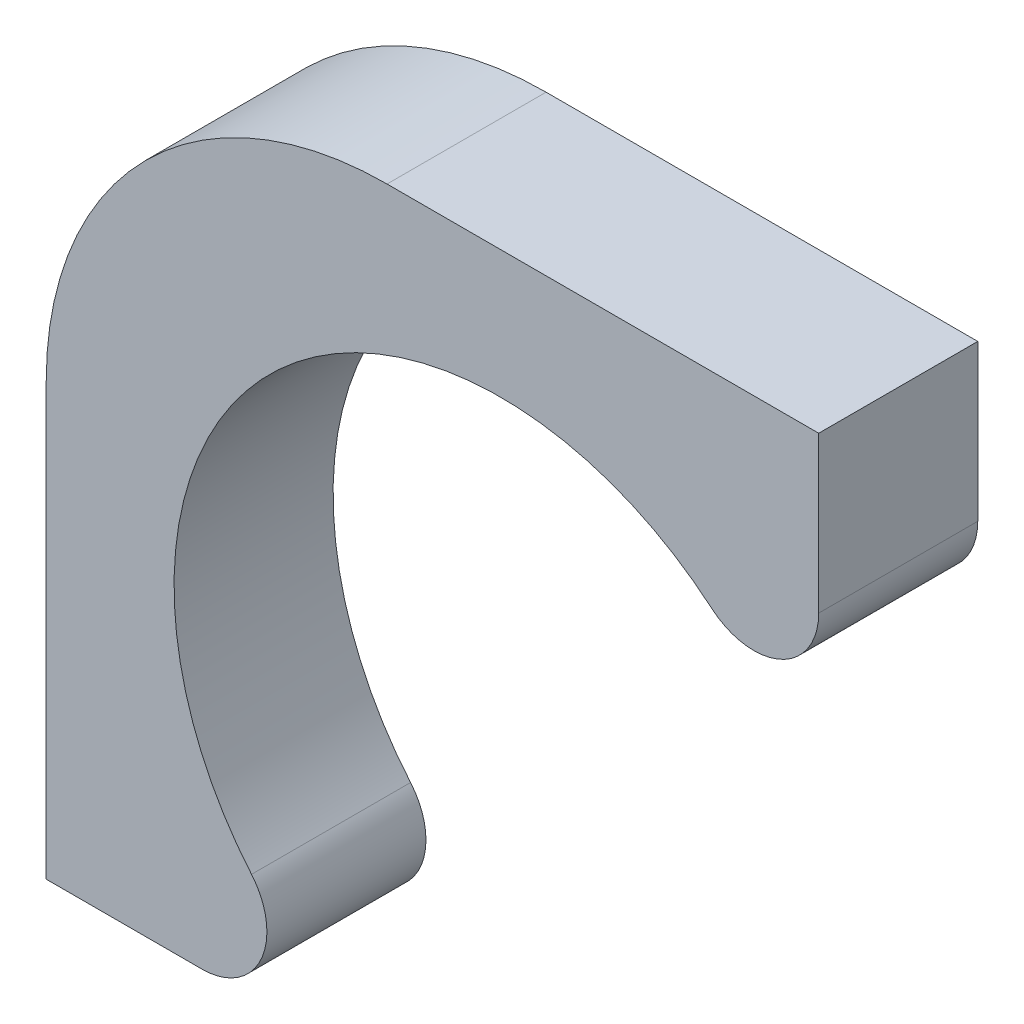
ISO-10303-21;
HEADER;
FILE_DESCRIPTION(('STEP AP214'),'2;1');
FILE_NAME('part.step','',(''),(''),'','','');
FILE_SCHEMA(('AUTOMOTIVE_DESIGN { 1 0 10303 214 1 1 1 1 }'));
ENDSEC;
DATA;
#1=APPLICATION_CONTEXT('core data for automotive mechanical design processes');
#2=APPLICATION_PROTOCOL_DEFINITION('international standard','automotive_design',2000,#1);
#3=PRODUCT_CONTEXT('',#1,'mechanical');
#4=PRODUCT('Part','Part','',(#3));
#5=PRODUCT_RELATED_PRODUCT_CATEGORY('part','',(#4));
#6=PRODUCT_DEFINITION_FORMATION('','',#4);
#7=PRODUCT_DEFINITION_CONTEXT('part definition',#1,'design');
#8=PRODUCT_DEFINITION('design','',#6,#7);
#9=PRODUCT_DEFINITION_SHAPE('','',#8);
#10=(LENGTH_UNIT() NAMED_UNIT(*) SI_UNIT(.MILLI.,.METRE.));
#11=(NAMED_UNIT(*) PLANE_ANGLE_UNIT() SI_UNIT($,.RADIAN.));
#12=(NAMED_UNIT(*) SI_UNIT($,.STERADIAN.) SOLID_ANGLE_UNIT());
#13=UNCERTAINTY_MEASURE_WITH_UNIT(LENGTH_MEASURE(1.E-05),#10,'distance_accuracy_value','');
#14=(GEOMETRIC_REPRESENTATION_CONTEXT(3) GLOBAL_UNCERTAINTY_ASSIGNED_CONTEXT((#13)) GLOBAL_UNIT_ASSIGNED_CONTEXT((#10,
#11,#12)) REPRESENTATION_CONTEXT('',''));
#15=CARTESIAN_POINT('',(0.,0.,0.));
#16=DIRECTION('',(0.,0.,1.));
#17=DIRECTION('',(1.,0.,0.));
#18=AXIS2_PLACEMENT_3D('',#15,#16,#17);
#19=CARTESIAN_POINT('',(-2.62868893926057,-2.22868893926067,1.4));
#20=DIRECTION('',(0.,0.,-1.));
#21=DIRECTION('',(-1.,0.,0.));
#22=AXIS2_PLACEMENT_3D('',#19,#20,#21);
#23=CYLINDRICAL_SURFACE('',#22,0.571311060739252);
#24=CARTESIAN_POINT('',(-2.62868893926057,-2.22868893926067,0.));
#25=DIRECTION('',(0.,0.,1.));
#26=DIRECTION('',(1.,0.,0.));
#27=AXIS2_PLACEMENT_3D('',#24,#25,#26);
#28=CIRCLE('',#27,0.571311060739252);
#29=CARTESIAN_POINT('',(-2.62868893926057,-2.79999999999992,0.));
#30=VERTEX_POINT('',#29);
#31=CARTESIAN_POINT('',(-2.19291891160661,-1.85922877750913,0.));
#32=VERTEX_POINT('',#31);
#33=EDGE_CURVE('E131',#30,#32,#28,.T.);
#34=ORIENTED_EDGE('',*,*,#33,.T.);
#35=DIRECTION('',(0.,0.,-1.));
#36=VECTOR('',#35,1.);
#37=CARTESIAN_POINT('',(-2.19291891160661,-1.85922877750913,1.4));
#38=LINE('',#37,#36);
#39=CARTESIAN_POINT('',(-2.19291891160661,-1.85922877750913,1.4));
#40=VERTEX_POINT('',#39);
#41=EDGE_CURVE('E11',#40,#32,#38,.T.);
#42=ORIENTED_EDGE('',*,*,#41,.F.);
#43=CARTESIAN_POINT('',(-2.62868893926057,-2.22868893926067,1.4));
#44=DIRECTION('',(0.,0.,1.));
#45=DIRECTION('',(1.,0.,0.));
#46=AXIS2_PLACEMENT_3D('',#43,#44,#45);
#47=CIRCLE('',#46,0.571311060739252);
#48=CARTESIAN_POINT('',(-2.62868893926057,-2.79999999999992,1.4));
#49=VERTEX_POINT('',#48);
#50=EDGE_CURVE('E145',#49,#40,#47,.T.);
#51=ORIENTED_EDGE('',*,*,#50,.F.);
#52=DIRECTION('',(0.,0.,-1.));
#53=VECTOR('',#52,1.);
#54=CARTESIAN_POINT('',(-2.62868893926057,-2.79999999999992,1.4));
#55=LINE('',#54,#53);
#56=EDGE_CURVE('E127',#49,#30,#55,.T.);
#57=ORIENTED_EDGE('',*,*,#56,.T.);
#58=EDGE_LOOP('',(#34,#42,#51,#57));
#59=FACE_BOUND('',#58,.T.);
#60=ADVANCED_FACE('F35',(#59),#23,.T.);
#61=CARTESIAN_POINT('',(0.,0.,1.4));
#62=DIRECTION('',(0.,0.,-1.));
#63=DIRECTION('',(-1.,0.,0.));
#64=AXIS2_PLACEMENT_3D('',#61,#62,#63);
#65=CYLINDRICAL_SURFACE('',#64,2.875);
#66=CARTESIAN_POINT('',(0.,0.,0.));
#67=DIRECTION('',(0.,0.,-1.));
#68=DIRECTION('',(-1.,0.,0.));
#69=AXIS2_PLACEMENT_3D('',#66,#67,#68);
#70=CIRCLE('',#69,2.875);
#71=CARTESIAN_POINT('',(1.85922877750913,2.19291891160661,0.));
#72=VERTEX_POINT('',#71);
#73=EDGE_CURVE('E134',#32,#72,#70,.T.);
#74=ORIENTED_EDGE('',*,*,#73,.T.);
#75=DIRECTION('',(0.,0.,-1.));
#76=VECTOR('',#75,1.);
#77=CARTESIAN_POINT('',(1.85922877750913,2.19291891160661,1.4));
#78=LINE('',#77,#76);
#79=CARTESIAN_POINT('',(1.85922877750913,2.19291891160661,1.4));
#80=VERTEX_POINT('',#79);
#81=EDGE_CURVE('E43',#80,#72,#78,.T.);
#82=ORIENTED_EDGE('',*,*,#81,.F.);
#83=CARTESIAN_POINT('',(0.,0.,1.4));
#84=DIRECTION('',(0.,0.,-1.));
#85=DIRECTION('',(-1.,0.,0.));
#86=AXIS2_PLACEMENT_3D('',#83,#84,#85);
#87=CIRCLE('',#86,2.875);
#88=EDGE_CURVE('E94',#40,#80,#87,.T.);
#89=ORIENTED_EDGE('',*,*,#88,.F.);
#90=ORIENTED_EDGE('',*,*,#41,.T.);
#91=EDGE_LOOP('',(#74,#82,#89,#90));
#92=FACE_BOUND('',#91,.T.);
#93=ADVANCED_FACE('F180',(#92),#65,.F.);
#94=CARTESIAN_POINT('',(2.22868893926067,2.62868893926057,1.4));
#95=DIRECTION('',(0.,0.,-1.));
#96=DIRECTION('',(-1.,0.,0.));
#97=AXIS2_PLACEMENT_3D('',#94,#95,#96);
#98=CYLINDRICAL_SURFACE('',#97,0.571311060739252);
#99=CARTESIAN_POINT('',(2.22868893926067,2.62868893926057,0.));
#100=DIRECTION('',(0.,0.,1.));
#101=DIRECTION('',(-1.,0.,0.));
#102=AXIS2_PLACEMENT_3D('',#99,#100,#101);
#103=CIRCLE('',#102,0.571311060739252);
#104=CARTESIAN_POINT('',(2.79999999999992,2.62868893926057,0.));
#105=VERTEX_POINT('',#104);
#106=EDGE_CURVE('E136',#72,#105,#103,.T.);
#107=ORIENTED_EDGE('',*,*,#106,.T.);
#108=DIRECTION('',(0.,0.,-1.));
#109=VECTOR('',#108,1.);
#110=CARTESIAN_POINT('',(2.79999999999992,2.62868893926057,1.4));
#111=LINE('',#110,#109);
#112=CARTESIAN_POINT('',(2.79999999999992,2.62868893926057,1.4));
#113=VERTEX_POINT('',#112);
#114=EDGE_CURVE('E152',#113,#105,#111,.T.);
#115=ORIENTED_EDGE('',*,*,#114,.F.);
#116=CARTESIAN_POINT('',(2.22868893926067,2.62868893926057,1.4));
#117=DIRECTION('',(0.,0.,1.));
#118=DIRECTION('',(-1.,0.,0.));
#119=AXIS2_PLACEMENT_3D('',#116,#117,#118);
#120=CIRCLE('',#119,0.571311060739252);
#121=EDGE_CURVE('E160',#80,#113,#120,.T.);
#122=ORIENTED_EDGE('',*,*,#121,.F.);
#123=ORIENTED_EDGE('',*,*,#81,.T.);
#124=EDGE_LOOP('',(#107,#115,#122,#123));
#125=FACE_BOUND('',#124,.T.);
#126=ADVANCED_FACE('F158',(#125),#98,.T.);
#127=CARTESIAN_POINT('',(2.79999999999992,4.,1.4));
#128=DIRECTION('',(-1.,0.,0.));
#129=DIRECTION('',(0.,0.,1.));
#130=AXIS2_PLACEMENT_3D('',#127,#128,#129);
#131=PLANE('',#130);
#132=DIRECTION('',(0.,1.,0.));
#133=VECTOR('',#132,1.);
#134=CARTESIAN_POINT('',(2.79999999999992,4.,0.));
#135=LINE('',#134,#133);
#136=CARTESIAN_POINT('',(2.79999999999992,4.,0.));
#137=VERTEX_POINT('',#136);
#138=EDGE_CURVE('E138',#105,#137,#135,.T.);
#139=ORIENTED_EDGE('',*,*,#138,.T.);
#140=DIRECTION('',(0.,0.,-1.));
#141=VECTOR('',#140,1.);
#142=CARTESIAN_POINT('',(2.79999999999992,4.,1.4));
#143=LINE('',#142,#141);
#144=CARTESIAN_POINT('',(2.79999999999992,4.,1.4));
#145=VERTEX_POINT('',#144);
#146=EDGE_CURVE('E149',#145,#137,#143,.T.);
#147=ORIENTED_EDGE('',*,*,#146,.F.);
#148=DIRECTION('',(0.,1.,0.));
#149=VECTOR('',#148,1.);
#150=CARTESIAN_POINT('',(2.79999999999992,4.,1.4));
#151=LINE('',#150,#149);
#152=EDGE_CURVE('E172',#113,#145,#151,.T.);
#153=ORIENTED_EDGE('',*,*,#152,.F.);
#154=ORIENTED_EDGE('',*,*,#114,.T.);
#155=EDGE_LOOP('',(#139,#147,#153,#154));
#156=FACE_BOUND('',#155,.T.);
#157=ADVANCED_FACE('F168',(#156),#131,.F.);
#158=CARTESIAN_POINT('',(2.79999999999992,4.,1.4));
#159=DIRECTION('',(0.,-1.,0.));
#160=DIRECTION('',(1.,0.,0.));
#161=AXIS2_PLACEMENT_3D('',#158,#159,#160);
#162=PLANE('',#161);
#163=DIRECTION('',(-1.,0.,0.));
#164=VECTOR('',#163,1.);
#165=CARTESIAN_POINT('',(2.79999999999992,4.,0.));
#166=LINE('',#165,#164);
#167=CARTESIAN_POINT('',(-1.00000000000009,4.,0.));
#168=VERTEX_POINT('',#167);
#169=EDGE_CURVE('E140',#137,#168,#166,.T.);
#170=ORIENTED_EDGE('',*,*,#169,.T.);
#171=DIRECTION('',(0.,0.,-1.));
#172=VECTOR('',#171,1.);
#173=CARTESIAN_POINT('',(-1.00000000000009,4.,1.4));
#174=LINE('',#173,#172);
#175=CARTESIAN_POINT('',(-1.00000000000009,4.,1.4));
#176=VERTEX_POINT('',#175);
#177=EDGE_CURVE('E122',#176,#168,#174,.T.);
#178=ORIENTED_EDGE('',*,*,#177,.F.);
#179=DIRECTION('',(-1.,0.,0.));
#180=VECTOR('',#179,1.);
#181=CARTESIAN_POINT('',(2.79999999999992,4.,1.4));
#182=LINE('',#181,#180);
#183=EDGE_CURVE('E113',#145,#176,#182,.T.);
#184=ORIENTED_EDGE('',*,*,#183,.F.);
#185=ORIENTED_EDGE('',*,*,#146,.T.);
#186=EDGE_LOOP('',(#170,#178,#184,#185));
#187=FACE_BOUND('',#186,.T.);
#188=ADVANCED_FACE('F171',(#187),#162,.F.);
#189=CARTESIAN_POINT('',(-1.00000000000009,1.00000000000009,1.4));
#190=DIRECTION('',(0.,0.,-1.));
#191=DIRECTION('',(-1.,0.,0.));
#192=AXIS2_PLACEMENT_3D('',#189,#190,#191);
#193=CYLINDRICAL_SURFACE('',#192,2.99999999999991);
#194=CARTESIAN_POINT('',(-1.00000000000009,1.00000000000009,0.));
#195=DIRECTION('',(0.,0.,1.));
#196=DIRECTION('',(1.,0.,0.));
#197=AXIS2_PLACEMENT_3D('',#194,#195,#196);
#198=CIRCLE('',#197,2.99999999999991);
#199=CARTESIAN_POINT('',(-4.,1.00000000000009,0.));
#200=VERTEX_POINT('',#199);
#201=EDGE_CURVE('E121',#168,#200,#198,.T.);
#202=ORIENTED_EDGE('',*,*,#201,.T.);
#203=DIRECTION('',(0.,0.,-1.));
#204=VECTOR('',#203,1.);
#205=CARTESIAN_POINT('',(-4.,1.00000000000009,1.4));
#206=LINE('',#205,#204);
#207=CARTESIAN_POINT('',(-4.,1.00000000000009,1.4));
#208=VERTEX_POINT('',#207);
#209=EDGE_CURVE('E118',#208,#200,#206,.T.);
#210=ORIENTED_EDGE('',*,*,#209,.F.);
#211=CARTESIAN_POINT('',(-1.00000000000009,1.00000000000009,1.4));
#212=DIRECTION('',(0.,0.,1.));
#213=DIRECTION('',(1.,0.,0.));
#214=AXIS2_PLACEMENT_3D('',#211,#212,#213);
#215=CIRCLE('',#214,2.99999999999991);
#216=EDGE_CURVE('E107',#176,#208,#215,.T.);
#217=ORIENTED_EDGE('',*,*,#216,.F.);
#218=ORIENTED_EDGE('',*,*,#177,.T.);
#219=EDGE_LOOP('',(#202,#210,#217,#218));
#220=FACE_BOUND('',#219,.T.);
#221=ADVANCED_FACE('F119',(#220),#193,.T.);
#222=CARTESIAN_POINT('',(-4.,1.00000000000009,1.4));
#223=DIRECTION('',(1.,0.,0.));
#224=DIRECTION('',(0.,1.,0.));
#225=AXIS2_PLACEMENT_3D('',#222,#223,#224);
#226=PLANE('',#225);
#227=DIRECTION('',(0.,-1.,0.));
#228=VECTOR('',#227,1.);
#229=CARTESIAN_POINT('',(-4.,1.00000000000009,0.));
#230=LINE('',#229,#228);
#231=CARTESIAN_POINT('',(-4.,-2.79999999999992,0.));
#232=VERTEX_POINT('',#231);
#233=EDGE_CURVE('E80',#200,#232,#230,.T.);
#234=ORIENTED_EDGE('',*,*,#233,.T.);
#235=DIRECTION('',(0.,0.,-1.));
#236=VECTOR('',#235,1.);
#237=CARTESIAN_POINT('',(-4.,-2.79999999999992,1.4));
#238=LINE('',#237,#236);
#239=CARTESIAN_POINT('',(-4.,-2.79999999999992,1.4));
#240=VERTEX_POINT('',#239);
#241=EDGE_CURVE('E123',#240,#232,#238,.T.);
#242=ORIENTED_EDGE('',*,*,#241,.F.);
#243=DIRECTION('',(0.,-1.,0.));
#244=VECTOR('',#243,1.);
#245=CARTESIAN_POINT('',(-4.,1.00000000000009,1.4));
#246=LINE('',#245,#244);
#247=EDGE_CURVE('E111',#208,#240,#246,.T.);
#248=ORIENTED_EDGE('',*,*,#247,.F.);
#249=ORIENTED_EDGE('',*,*,#209,.T.);
#250=EDGE_LOOP('',(#234,#242,#248,#249));
#251=FACE_BOUND('',#250,.T.);
#252=ADVANCED_FACE('F125',(#251),#226,.F.);
#253=CARTESIAN_POINT('',(-4.,-2.79999999999992,1.4));
#254=DIRECTION('',(0.,1.,0.));
#255=DIRECTION('',(-1.,0.,0.));
#256=AXIS2_PLACEMENT_3D('',#253,#254,#255);
#257=PLANE('',#256);
#258=DIRECTION('',(1.,0.,0.));
#259=VECTOR('',#258,1.);
#260=CARTESIAN_POINT('',(-4.,-2.79999999999992,0.));
#261=LINE('',#260,#259);
#262=EDGE_CURVE('E86',#232,#30,#261,.T.);
#263=ORIENTED_EDGE('',*,*,#262,.T.);
#264=ORIENTED_EDGE('',*,*,#56,.F.);
#265=DIRECTION('',(1.,0.,0.));
#266=VECTOR('',#265,1.);
#267=CARTESIAN_POINT('',(-4.,-2.79999999999992,1.4));
#268=LINE('',#267,#266);
#269=EDGE_CURVE('E51',#240,#49,#268,.T.);
#270=ORIENTED_EDGE('',*,*,#269,.F.);
#271=ORIENTED_EDGE('',*,*,#241,.T.);
#272=EDGE_LOOP('',(#263,#264,#270,#271));
#273=FACE_BOUND('',#272,.T.);
#274=ADVANCED_FACE('F196',(#273),#257,.F.);
#275=CARTESIAN_POINT('',(-2.62868893926057,-2.22868893926067,1.4));
#276=DIRECTION('',(0.,0.,1.));
#277=DIRECTION('',(1.,0.,0.));
#278=AXIS2_PLACEMENT_3D('',#275,#276,#277);
#279=PLANE('',#278);
#280=ORIENTED_EDGE('',*,*,#50,.T.);
#281=ORIENTED_EDGE('',*,*,#88,.T.);
#282=ORIENTED_EDGE('',*,*,#121,.T.);
#283=ORIENTED_EDGE('',*,*,#152,.T.);
#284=ORIENTED_EDGE('',*,*,#183,.T.);
#285=ORIENTED_EDGE('',*,*,#216,.T.);
#286=ORIENTED_EDGE('',*,*,#247,.T.);
#287=ORIENTED_EDGE('',*,*,#269,.T.);
#288=EDGE_LOOP('',(#280,#281,#282,#283,#284,#285,#286,#287));
#289=FACE_BOUND('',#288,.T.);
#290=ADVANCED_FACE('F109',(#289),#279,.T.);
#291=CARTESIAN_POINT('',(-2.62868893926057,-2.22868893926067,0.));
#292=DIRECTION('',(0.,0.,1.));
#293=DIRECTION('',(1.,0.,0.));
#294=AXIS2_PLACEMENT_3D('',#291,#292,#293);
#295=PLANE('',#294);
#296=ORIENTED_EDGE('',*,*,#33,.F.);
#297=ORIENTED_EDGE('',*,*,#262,.F.);
#298=ORIENTED_EDGE('',*,*,#233,.F.);
#299=ORIENTED_EDGE('',*,*,#201,.F.);
#300=ORIENTED_EDGE('',*,*,#169,.F.);
#301=ORIENTED_EDGE('',*,*,#138,.F.);
#302=ORIENTED_EDGE('',*,*,#106,.F.);
#303=ORIENTED_EDGE('',*,*,#73,.F.);
#304=EDGE_LOOP('',(#296,#297,#298,#299,#300,#301,#302,#303));
#305=FACE_BOUND('',#304,.T.);
#306=ADVANCED_FACE('F164',(#305),#295,.F.);
#307=CLOSED_SHELL('',(#60,#93,#126,#157,#188,#221,#252,#274,#290,#306));
#308=MANIFOLD_SOLID_BREP('B2',#307);
#309=ADVANCED_BREP_SHAPE_REPRESENTATION('',(#18,#308),#14);
#310=SHAPE_DEFINITION_REPRESENTATION(#9,#309);
ENDSEC;
END-ISO-10303-21;
